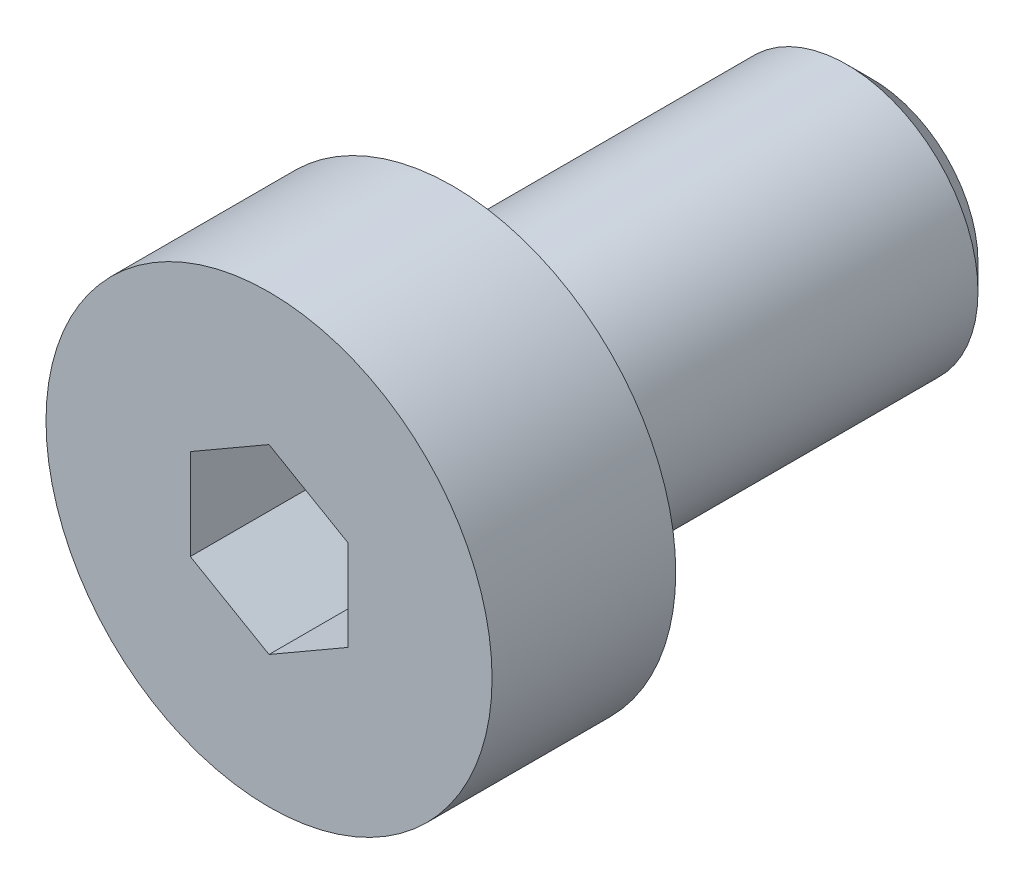
ISO-10303-21;
HEADER;
FILE_DESCRIPTION(('STEP AP214'),'2;1');
FILE_NAME('part.step','',(''),(''),'','','');
FILE_SCHEMA(('AUTOMOTIVE_DESIGN { 1 0 10303 214 1 1 1 1 }'));
ENDSEC;
DATA;
#1=APPLICATION_CONTEXT('core data for automotive mechanical design processes');
#2=APPLICATION_PROTOCOL_DEFINITION('international standard','automotive_design',2000,#1);
#3=PRODUCT_CONTEXT('',#1,'mechanical');
#4=PRODUCT('Part','Part','',(#3));
#5=PRODUCT_RELATED_PRODUCT_CATEGORY('part','',(#4));
#6=PRODUCT_DEFINITION_FORMATION('','',#4);
#7=PRODUCT_DEFINITION_CONTEXT('part definition',#1,'design');
#8=PRODUCT_DEFINITION('design','',#6,#7);
#9=PRODUCT_DEFINITION_SHAPE('','',#8);
#10=(LENGTH_UNIT() NAMED_UNIT(*) SI_UNIT(.MILLI.,.METRE.));
#11=(NAMED_UNIT(*) PLANE_ANGLE_UNIT() SI_UNIT($,.RADIAN.));
#12=(NAMED_UNIT(*) SI_UNIT($,.STERADIAN.) SOLID_ANGLE_UNIT());
#13=UNCERTAINTY_MEASURE_WITH_UNIT(LENGTH_MEASURE(1.E-05),#10,'distance_accuracy_value','');
#14=(GEOMETRIC_REPRESENTATION_CONTEXT(3) GLOBAL_UNCERTAINTY_ASSIGNED_CONTEXT((#13)) GLOBAL_UNIT_ASSIGNED_CONTEXT((#10,
#11,#12)) REPRESENTATION_CONTEXT('',''));
#15=CARTESIAN_POINT('',(0.,0.,0.));
#16=DIRECTION('',(0.,0.,1.));
#17=DIRECTION('',(1.,0.,0.));
#18=AXIS2_PLACEMENT_3D('',#15,#16,#17);
#19=CARTESIAN_POINT('',(13.,21.5,-3.3));
#20=DIRECTION('',(0.,0.,-1.));
#21=DIRECTION('',(-1.,0.,0.));
#22=AXIS2_PLACEMENT_3D('',#19,#20,#21);
#23=PLANE('',#22);
#24=DIRECTION('',(-0.866025403784439,0.5,0.));
#25=VECTOR('',#24,1.);
#26=CARTESIAN_POINT('',(14.5,22.3660254037844,-3.3));
#27=LINE('',#26,#25);
#28=CARTESIAN_POINT('',(13.7500000000045,22.7990381056845,-3.29999999999793));
#29=VERTEX_POINT('',#28);
#30=CARTESIAN_POINT('',(13.,23.2320508075689,-3.3));
#31=VERTEX_POINT('',#30);
#32=EDGE_CURVE('E179',#29,#31,#27,.T.);
#33=ORIENTED_EDGE('',*,*,#32,.T.);
#34=DIRECTION('',(-0.866025403784439,-0.5,0.));
#35=VECTOR('',#34,1.);
#36=CARTESIAN_POINT('',(13.,23.2320508075689,-3.3));
#37=LINE('',#36,#35);
#38=CARTESIAN_POINT('',(12.2499999999955,22.7990381056846,-3.29999999999793));
#39=VERTEX_POINT('',#38);
#40=EDGE_CURVE('E169',#31,#39,#37,.T.);
#41=ORIENTED_EDGE('',*,*,#40,.T.);
#42=CARTESIAN_POINT('',(13.,21.5,-3.29999999999586));
#43=DIRECTION('',(0.,0.,1.));
#44=DIRECTION('',(1.,0.,0.));
#45=AXIS2_PLACEMENT_3D('',#42,#43,#44);
#46=CIRCLE('',#45,1.50000000001819);
#47=EDGE_CURVE('E130',#39,#29,#46,.F.);
#48=ORIENTED_EDGE('',*,*,#47,.T.);
#49=EDGE_LOOP('',(#33,#41,#48));
#50=FACE_BOUND('',#49,.T.);
#51=ADVANCED_FACE('F17',(#50),#23,.F.);
#52=CARTESIAN_POINT('',(13.,21.5,-3.3));
#53=DIRECTION('',(0.,0.,-1.));
#54=DIRECTION('',(-1.,0.,0.));
#55=AXIS2_PLACEMENT_3D('',#52,#53,#54);
#56=PLANE('',#55);
#57=DIRECTION('',(0.,1.,0.));
#58=VECTOR('',#57,1.);
#59=CARTESIAN_POINT('',(14.5,20.6339745962156,-3.3));
#60=LINE('',#59,#58);
#61=CARTESIAN_POINT('',(14.5000000000091,21.5,-3.29999999999793));
#62=VERTEX_POINT('',#61);
#63=CARTESIAN_POINT('',(14.5,22.3660254037844,-3.3));
#64=VERTEX_POINT('',#63);
#65=EDGE_CURVE('E147',#62,#64,#60,.T.);
#66=ORIENTED_EDGE('',*,*,#65,.T.);
#67=DIRECTION('',(-0.866025403784439,0.5,0.));
#68=VECTOR('',#67,1.);
#69=CARTESIAN_POINT('',(14.5,22.3660254037844,-3.3));
#70=LINE('',#69,#68);
#71=EDGE_CURVE('E176',#64,#29,#70,.T.);
#72=ORIENTED_EDGE('',*,*,#71,.T.);
#73=CARTESIAN_POINT('',(13.,21.5,-3.29999999999586));
#74=DIRECTION('',(0.,0.,1.));
#75=DIRECTION('',(1.,0.,0.));
#76=AXIS2_PLACEMENT_3D('',#73,#74,#75);
#77=CIRCLE('',#76,1.50000000001819);
#78=EDGE_CURVE('E180',#62,#29,#77,.T.);
#79=ORIENTED_EDGE('',*,*,#78,.F.);
#80=EDGE_LOOP('',(#66,#72,#79));
#81=FACE_BOUND('',#80,.T.);
#82=ADVANCED_FACE('F512',(#81),#56,.F.);
#83=CARTESIAN_POINT('',(14.5,22.3660254037844,-0.6));
#84=DIRECTION('',(0.5,0.866025403784439,0.));
#85=DIRECTION('',(-0.866025403784439,0.5,0.));
#86=AXIS2_PLACEMENT_3D('',#83,#84,#85);
#87=PLANE('',#86);
#88=DIRECTION('',(0.,0.,1.));
#89=VECTOR('',#88,1.);
#90=CARTESIAN_POINT('',(13.,23.2320508075689,-0.6));
#91=LINE('',#90,#89);
#92=CARTESIAN_POINT('',(13.,23.2320508075689,-0.6));
#93=VERTEX_POINT('',#92);
#94=EDGE_CURVE('E188',#93,#31,#91,.F.);
#95=ORIENTED_EDGE('',*,*,#94,.T.);
#96=ORIENTED_EDGE('',*,*,#32,.F.);
#97=ORIENTED_EDGE('',*,*,#71,.F.);
#98=DIRECTION('',(0.,0.,-1.));
#99=VECTOR('',#98,1.);
#100=CARTESIAN_POINT('',(14.5,22.3660254037844,-0.6));
#101=LINE('',#100,#99);
#102=CARTESIAN_POINT('',(14.5,22.3660254037844,-0.6));
#103=VERTEX_POINT('',#102);
#104=EDGE_CURVE('E173',#64,#103,#101,.F.);
#105=ORIENTED_EDGE('',*,*,#104,.T.);
#106=DIRECTION('',(-0.866025403784439,0.5,0.));
#107=VECTOR('',#106,1.);
#108=CARTESIAN_POINT('',(14.5,22.3660254037844,-0.6));
#109=LINE('',#108,#107);
#110=EDGE_CURVE('E193',#93,#103,#109,.F.);
#111=ORIENTED_EDGE('',*,*,#110,.F.);
#112=EDGE_LOOP('',(#95,#96,#97,#105,#111));
#113=FACE_BOUND('',#112,.T.);
#114=ADVANCED_FACE('F502',(#113),#87,.F.);
#115=CARTESIAN_POINT('',(13.,23.2320508075689,-0.6));
#116=DIRECTION('',(-0.5,0.866025403784439,0.));
#117=DIRECTION('',(-0.866025403784439,-0.5,0.));
#118=AXIS2_PLACEMENT_3D('',#115,#116,#117);
#119=PLANE('',#118);
#120=DIRECTION('',(0.,0.,1.));
#121=VECTOR('',#120,1.);
#122=CARTESIAN_POINT('',(11.5,22.3660254037844,-0.6));
#123=LINE('',#122,#121);
#124=CARTESIAN_POINT('',(11.5,22.3660254037844,-0.6));
#125=VERTEX_POINT('',#124);
#126=CARTESIAN_POINT('',(11.5,22.3660254037844,-3.3));
#127=VERTEX_POINT('',#126);
#128=EDGE_CURVE('E155',#125,#127,#123,.F.);
#129=ORIENTED_EDGE('',*,*,#128,.T.);
#130=DIRECTION('',(0.866025403784398,0.500000000000071,0.));
#131=VECTOR('',#130,1.);
#132=CARTESIAN_POINT('',(11.5,22.3660254037844,-3.3));
#133=LINE('',#132,#131);
#134=EDGE_CURVE('E112',#127,#39,#133,.T.);
#135=ORIENTED_EDGE('',*,*,#134,.T.);
#136=ORIENTED_EDGE('',*,*,#40,.F.);
#137=ORIENTED_EDGE('',*,*,#94,.F.);
#138=DIRECTION('',(-0.866025403784439,-0.5,0.));
#139=VECTOR('',#138,1.);
#140=CARTESIAN_POINT('',(13.,23.2320508075689,-0.6));
#141=LINE('',#140,#139);
#142=EDGE_CURVE('E164',#125,#93,#141,.F.);
#143=ORIENTED_EDGE('',*,*,#142,.F.);
#144=EDGE_LOOP('',(#129,#135,#136,#137,#143));
#145=FACE_BOUND('',#144,.T.);
#146=ADVANCED_FACE('F492',(#145),#119,.F.);
#147=CARTESIAN_POINT('',(13.,21.5,-3.3));
#148=DIRECTION('',(0.,0.,-1.));
#149=DIRECTION('',(-1.,0.,0.));
#150=AXIS2_PLACEMENT_3D('',#147,#148,#149);
#151=PLANE('',#150);
#152=ORIENTED_EDGE('',*,*,#134,.F.);
#153=DIRECTION('',(0.,1.,0.));
#154=VECTOR('',#153,1.);
#155=CARTESIAN_POINT('',(11.5,22.3660254037844,-3.3));
#156=LINE('',#155,#154);
#157=CARTESIAN_POINT('',(11.4999999999909,21.5,-3.29999999999793));
#158=VERTEX_POINT('',#157);
#159=EDGE_CURVE('E152',#127,#158,#156,.F.);
#160=ORIENTED_EDGE('',*,*,#159,.T.);
#161=CARTESIAN_POINT('',(13.,21.5,-3.29999999999586));
#162=DIRECTION('',(0.,0.,1.));
#163=DIRECTION('',(1.,0.,0.));
#164=AXIS2_PLACEMENT_3D('',#161,#162,#163);
#165=CIRCLE('',#164,1.50000000001819);
#166=EDGE_CURVE('E111',#158,#39,#165,.F.);
#167=ORIENTED_EDGE('',*,*,#166,.T.);
#168=EDGE_LOOP('',(#152,#160,#167));
#169=FACE_BOUND('',#168,.T.);
#170=ADVANCED_FACE('F483',(#169),#151,.F.);
#171=CARTESIAN_POINT('',(13.,21.5,-3.29999999999586));
#172=DIRECTION('',(0.,0.,1.));
#173=DIRECTION('',(1.,0.,0.));
#174=AXIS2_PLACEMENT_3D('',#171,#172,#173);
#175=CONICAL_SURFACE('',#174,1.50000000001819,1.22173047637907);
#176=CARTESIAN_POINT('',(13.,21.5,-3.29999999999586));
#177=DIRECTION('',(0.,0.,1.));
#178=DIRECTION('',(1.,0.,0.));
#179=AXIS2_PLACEMENT_3D('',#176,#177,#178);
#180=CIRCLE('',#179,1.50000000001819);
#181=CARTESIAN_POINT('',(13.7500000000045,20.2009618943154,-3.29999999999793));
#182=VERTEX_POINT('',#181);
#183=CARTESIAN_POINT('',(12.2499999999955,20.2009618943155,-3.29999999999793));
#184=VERTEX_POINT('',#183);
#185=EDGE_CURVE('E98',#182,#184,#180,.F.);
#186=ORIENTED_EDGE('',*,*,#185,.F.);
#187=CARTESIAN_POINT('',(13.,21.5,-3.29999999999586));
#188=DIRECTION('',(0.,0.,1.));
#189=DIRECTION('',(1.,0.,0.));
#190=AXIS2_PLACEMENT_3D('',#187,#188,#189);
#191=CIRCLE('',#190,1.50000000001819);
#192=EDGE_CURVE('E104',#182,#62,#191,.T.);
#193=ORIENTED_EDGE('',*,*,#192,.T.);
#194=ORIENTED_EDGE('',*,*,#78,.T.);
#195=ORIENTED_EDGE('',*,*,#47,.F.);
#196=ORIENTED_EDGE('',*,*,#166,.F.);
#197=CARTESIAN_POINT('',(13.,21.5,-3.29999999999586));
#198=DIRECTION('',(0.,0.,1.));
#199=DIRECTION('',(1.,0.,0.));
#200=AXIS2_PLACEMENT_3D('',#197,#198,#199);
#201=CIRCLE('',#200,1.50000000001819);
#202=EDGE_CURVE('E108',#158,#184,#201,.T.);
#203=ORIENTED_EDGE('',*,*,#202,.T.);
#204=EDGE_LOOP('',(#186,#193,#194,#195,#196,#203));
#205=FACE_BOUND('',#204,.T.);
#206=CARTESIAN_POINT('',(13.,21.50000000006,-3.84595535139454));
#207=VERTEX_POINT('',#206);
#208=VERTEX_LOOP('',#207);
#209=FACE_BOUND('',#208,.T.);
#210=ADVANCED_FACE('F100',(#205,#209),#175,.F.);
#211=CARTESIAN_POINT('',(13.,21.5,-3.3));
#212=DIRECTION('',(0.,0.,-1.));
#213=DIRECTION('',(-1.,0.,0.));
#214=AXIS2_PLACEMENT_3D('',#211,#212,#213);
#215=PLANE('',#214);
#216=DIRECTION('',(0.866025403784439,0.5,0.));
#217=VECTOR('',#216,1.);
#218=CARTESIAN_POINT('',(13.,19.7679491924311,-3.3));
#219=LINE('',#218,#217);
#220=CARTESIAN_POINT('',(14.5,20.6339745962156,-3.3));
#221=VERTEX_POINT('',#220);
#222=EDGE_CURVE('E123',#182,#221,#219,.T.);
#223=ORIENTED_EDGE('',*,*,#222,.T.);
#224=DIRECTION('',(0.,1.,0.));
#225=VECTOR('',#224,1.);
#226=CARTESIAN_POINT('',(14.5,20.6339745962156,-3.3));
#227=LINE('',#226,#225);
#228=EDGE_CURVE('E128',#221,#62,#227,.T.);
#229=ORIENTED_EDGE('',*,*,#228,.T.);
#230=ORIENTED_EDGE('',*,*,#192,.F.);
#231=EDGE_LOOP('',(#223,#229,#230));
#232=FACE_BOUND('',#231,.T.);
#233=ADVANCED_FACE('F126',(#232),#215,.F.);
#234=CARTESIAN_POINT('',(14.5,20.6339745962156,-0.6));
#235=DIRECTION('',(1.,0.,0.));
#236=DIRECTION('',(0.,0.,-1.));
#237=AXIS2_PLACEMENT_3D('',#234,#235,#236);
#238=PLANE('',#237);
#239=ORIENTED_EDGE('',*,*,#104,.F.);
#240=ORIENTED_EDGE('',*,*,#65,.F.);
#241=ORIENTED_EDGE('',*,*,#228,.F.);
#242=DIRECTION('',(0.,0.,1.));
#243=VECTOR('',#242,1.);
#244=CARTESIAN_POINT('',(14.5,20.6339745962156,-0.6));
#245=LINE('',#244,#243);
#246=CARTESIAN_POINT('',(14.5,20.6339745962156,-0.6));
#247=VERTEX_POINT('',#246);
#248=EDGE_CURVE('E136',#221,#247,#245,.T.);
#249=ORIENTED_EDGE('',*,*,#248,.T.);
#250=DIRECTION('',(0.,1.,0.));
#251=VECTOR('',#250,1.);
#252=CARTESIAN_POINT('',(14.5,20.6339745962156,-0.6));
#253=LINE('',#252,#251);
#254=EDGE_CURVE('E159',#103,#247,#253,.F.);
#255=ORIENTED_EDGE('',*,*,#254,.F.);
#256=EDGE_LOOP('',(#239,#240,#241,#249,#255));
#257=FACE_BOUND('',#256,.T.);
#258=ADVANCED_FACE('F285',(#257),#238,.F.);
#259=CARTESIAN_POINT('',(11.5,22.3660254037844,-0.6));
#260=DIRECTION('',(-1.,0.,0.));
#261=DIRECTION('',(0.,0.,1.));
#262=AXIS2_PLACEMENT_3D('',#259,#260,#261);
#263=PLANE('',#262);
#264=DIRECTION('',(0.,0.,1.));
#265=VECTOR('',#264,1.);
#266=CARTESIAN_POINT('',(11.5,20.6339745962156,-0.6));
#267=LINE('',#266,#265);
#268=CARTESIAN_POINT('',(11.5,20.6339745962156,-0.6));
#269=VERTEX_POINT('',#268);
#270=CARTESIAN_POINT('',(11.5,20.6339745962156,-3.3));
#271=VERTEX_POINT('',#270);
#272=EDGE_CURVE('E238',#269,#271,#267,.F.);
#273=ORIENTED_EDGE('',*,*,#272,.T.);
#274=DIRECTION('',(0.,1.,0.));
#275=VECTOR('',#274,1.);
#276=CARTESIAN_POINT('',(11.5,21.5,-3.3));
#277=LINE('',#276,#275);
#278=EDGE_CURVE('E216',#271,#158,#277,.T.);
#279=ORIENTED_EDGE('',*,*,#278,.T.);
#280=ORIENTED_EDGE('',*,*,#159,.F.);
#281=ORIENTED_EDGE('',*,*,#128,.F.);
#282=DIRECTION('',(0.,1.,0.));
#283=VECTOR('',#282,1.);
#284=CARTESIAN_POINT('',(11.5,22.3660254037844,-0.6));
#285=LINE('',#284,#283);
#286=EDGE_CURVE('E154',#269,#125,#285,.T.);
#287=ORIENTED_EDGE('',*,*,#286,.F.);
#288=EDGE_LOOP('',(#273,#279,#280,#281,#287));
#289=FACE_BOUND('',#288,.T.);
#290=ADVANCED_FACE('F273',(#289),#263,.F.);
#291=CARTESIAN_POINT('',(13.,21.5,-3.3));
#292=DIRECTION('',(0.,0.,-1.));
#293=DIRECTION('',(-1.,0.,0.));
#294=AXIS2_PLACEMENT_3D('',#291,#292,#293);
#295=PLANE('',#294);
#296=ORIENTED_EDGE('',*,*,#278,.F.);
#297=DIRECTION('',(0.866025403784439,-0.5,0.));
#298=VECTOR('',#297,1.);
#299=CARTESIAN_POINT('',(11.5,20.6339745962156,-3.3));
#300=LINE('',#299,#298);
#301=EDGE_CURVE('E239',#271,#184,#300,.T.);
#302=ORIENTED_EDGE('',*,*,#301,.T.);
#303=ORIENTED_EDGE('',*,*,#202,.F.);
#304=EDGE_LOOP('',(#296,#302,#303));
#305=FACE_BOUND('',#304,.T.);
#306=ADVANCED_FACE('F276',(#305),#295,.F.);
#307=CARTESIAN_POINT('',(13.,21.5,-3.3));
#308=DIRECTION('',(0.,0.,-1.));
#309=DIRECTION('',(-1.,0.,0.));
#310=AXIS2_PLACEMENT_3D('',#307,#308,#309);
#311=PLANE('',#310);
#312=DIRECTION('',(0.866025403784439,-0.5,0.));
#313=VECTOR('',#312,1.);
#314=CARTESIAN_POINT('',(11.5,20.6339745962156,-3.3));
#315=LINE('',#314,#313);
#316=CARTESIAN_POINT('',(13.,19.7679491924311,-3.3));
#317=VERTEX_POINT('',#316);
#318=EDGE_CURVE('E118',#184,#317,#315,.T.);
#319=ORIENTED_EDGE('',*,*,#318,.T.);
#320=DIRECTION('',(0.866025403784439,0.5,0.));
#321=VECTOR('',#320,1.);
#322=CARTESIAN_POINT('',(13.,19.7679491924311,-3.3));
#323=LINE('',#322,#321);
#324=EDGE_CURVE('E115',#317,#182,#323,.T.);
#325=ORIENTED_EDGE('',*,*,#324,.T.);
#326=ORIENTED_EDGE('',*,*,#185,.T.);
#327=EDGE_LOOP('',(#319,#325,#326));
#328=FACE_BOUND('',#327,.T.);
#329=ADVANCED_FACE('F116',(#328),#311,.F.);
#330=CARTESIAN_POINT('',(13.,19.7679491924311,-0.6));
#331=DIRECTION('',(0.5,-0.866025403784439,0.));
#332=DIRECTION('',(0.866025403784439,0.5,0.));
#333=AXIS2_PLACEMENT_3D('',#330,#331,#332);
#334=PLANE('',#333);
#335=ORIENTED_EDGE('',*,*,#248,.F.);
#336=ORIENTED_EDGE('',*,*,#222,.F.);
#337=ORIENTED_EDGE('',*,*,#324,.F.);
#338=DIRECTION('',(0.,0.,1.));
#339=VECTOR('',#338,1.);
#340=CARTESIAN_POINT('',(13.,19.7679491924311,-0.6));
#341=LINE('',#340,#339);
#342=CARTESIAN_POINT('',(13.,19.7679491924311,-0.6));
#343=VERTEX_POINT('',#342);
#344=EDGE_CURVE('E244',#317,#343,#341,.T.);
#345=ORIENTED_EDGE('',*,*,#344,.T.);
#346=DIRECTION('',(0.866025403784439,0.5,0.));
#347=VECTOR('',#346,1.);
#348=CARTESIAN_POINT('',(13.,19.7679491924311,-0.6));
#349=LINE('',#348,#347);
#350=EDGE_CURVE('E138',#247,#343,#349,.F.);
#351=ORIENTED_EDGE('',*,*,#350,.F.);
#352=EDGE_LOOP('',(#335,#336,#337,#345,#351));
#353=FACE_BOUND('',#352,.T.);
#354=ADVANCED_FACE('F133',(#353),#334,.F.);
#355=CARTESIAN_POINT('',(11.5,20.6339745962156,-0.6));
#356=DIRECTION('',(-0.5,-0.866025403784439,0.));
#357=DIRECTION('',(0.866025403784439,-0.5,0.));
#358=AXIS2_PLACEMENT_3D('',#355,#356,#357);
#359=PLANE('',#358);
#360=ORIENTED_EDGE('',*,*,#344,.F.);
#361=ORIENTED_EDGE('',*,*,#318,.F.);
#362=ORIENTED_EDGE('',*,*,#301,.F.);
#363=ORIENTED_EDGE('',*,*,#272,.F.);
#364=DIRECTION('',(-0.866025403784424,0.500000000000026,0.));
#365=VECTOR('',#364,1.);
#366=CARTESIAN_POINT('',(13.,19.7679491924311,-0.6));
#367=LINE('',#366,#365);
#368=EDGE_CURVE('E215',#343,#269,#367,.T.);
#369=ORIENTED_EDGE('',*,*,#368,.F.);
#370=EDGE_LOOP('',(#360,#361,#362,#363,#369));
#371=FACE_BOUND('',#370,.T.);
#372=ADVANCED_FACE('F269',(#371),#359,.F.);
#373=CARTESIAN_POINT('',(13.,19.375,-0.6));
#374=DIRECTION('',(0.,0.,1.));
#375=DIRECTION('',(1.,0.,0.));
#376=AXIS2_PLACEMENT_3D('',#373,#374,#375);
#377=PLANE('',#376);
#378=CARTESIAN_POINT('',(13.,21.5,-0.6));
#379=DIRECTION('',(0.,0.,-1.));
#380=DIRECTION('',(-1.,0.,0.));
#381=AXIS2_PLACEMENT_3D('',#378,#379,#380);
#382=CIRCLE('',#381,4.25);
#383=CARTESIAN_POINT('',(8.75,21.5,-0.6));
#384=VERTEX_POINT('',#383);
#385=EDGE_CURVE('E212',#384,#384,#382,.T.);
#386=ORIENTED_EDGE('',*,*,#385,.F.);
#387=EDGE_LOOP('',(#386));
#388=FACE_BOUND('',#387,.T.);
#389=ORIENTED_EDGE('',*,*,#350,.T.);
#390=ORIENTED_EDGE('',*,*,#368,.T.);
#391=ORIENTED_EDGE('',*,*,#286,.T.);
#392=ORIENTED_EDGE('',*,*,#142,.T.);
#393=ORIENTED_EDGE('',*,*,#110,.T.);
#394=ORIENTED_EDGE('',*,*,#254,.T.);
#395=EDGE_LOOP('',(#389,#390,#391,#392,#393,#394));
#396=FACE_BOUND('',#395,.T.);
#397=ADVANCED_FACE('F265',(#388,#396),#377,.T.);
#398=CARTESIAN_POINT('',(13.,21.5,-2.35));
#399=DIRECTION('',(0.,0.,-1.));
#400=DIRECTION('',(-1.,0.,0.));
#401=AXIS2_PLACEMENT_3D('',#398,#399,#400);
#402=CYLINDRICAL_SURFACE('',#401,4.25);
#403=ORIENTED_EDGE('',*,*,#385,.T.);
#404=EDGE_LOOP('',(#403));
#405=FACE_BOUND('',#404,.T.);
#406=CARTESIAN_POINT('',(13.,21.5,-4.1));
#407=DIRECTION('',(0.,0.,-1.));
#408=DIRECTION('',(-1.,0.,0.));
#409=AXIS2_PLACEMENT_3D('',#406,#407,#408);
#410=CIRCLE('',#409,4.25);
#411=CARTESIAN_POINT('',(8.75,21.5,-4.1));
#412=VERTEX_POINT('',#411);
#413=EDGE_CURVE('E209',#412,#412,#410,.T.);
#414=ORIENTED_EDGE('',*,*,#413,.F.);
#415=EDGE_LOOP('',(#414));
#416=FACE_BOUND('',#415,.T.);
#417=ADVANCED_FACE('F350',(#405,#416),#402,.T.);
#418=CARTESIAN_POINT('',(13.,20.49525,-12.1));
#419=DIRECTION('',(0.,0.,-1.));
#420=DIRECTION('',(-1.,0.,0.));
#421=AXIS2_PLACEMENT_3D('',#418,#419,#420);
#422=PLANE('',#421);
#423=CARTESIAN_POINT('',(13.,21.5,-12.0999999999754));
#424=DIRECTION('',(0.,0.,1.));
#425=DIRECTION('',(1.,0.,0.));
#426=AXIS2_PLACEMENT_3D('',#423,#424,#425);
#427=CIRCLE('',#426,2.00950000003923);
#428=CARTESIAN_POINT('',(15.0095000000392,21.5,-12.0999999999754));
#429=VERTEX_POINT('',#428);
#430=EDGE_CURVE('E205',#429,#429,#427,.T.);
#431=ORIENTED_EDGE('',*,*,#430,.F.);
#432=EDGE_LOOP('',(#431));
#433=FACE_BOUND('',#432,.T.);
#434=ADVANCED_FACE('F316',(#433),#422,.T.);
#435=CARTESIAN_POINT('',(13.,18.025,-4.1));
#436=DIRECTION('',(0.,0.,-1.));
#437=DIRECTION('',(-1.,0.,0.));
#438=AXIS2_PLACEMENT_3D('',#435,#436,#437);
#439=PLANE('',#438);
#440=CARTESIAN_POINT('',(13.,21.5,-4.1));
#441=DIRECTION('',(0.,0.,-1.));
#442=DIRECTION('',(-1.,0.,0.));
#443=AXIS2_PLACEMENT_3D('',#440,#441,#442);
#444=CIRCLE('',#443,2.7);
#445=CARTESIAN_POINT('',(15.7,21.5,-4.1));
#446=VERTEX_POINT('',#445);
#447=CARTESIAN_POINT('',(10.3,21.5,-4.1));
#448=VERTEX_POINT('',#447);
#449=EDGE_CURVE('E208',#446,#448,#444,.F.);
#450=ORIENTED_EDGE('',*,*,#449,.T.);
#451=CARTESIAN_POINT('',(13.,21.5,-4.1));
#452=DIRECTION('',(0.,0.,-1.));
#453=DIRECTION('',(0.,-1.,0.));
#454=AXIS2_PLACEMENT_3D('',#451,#452,#453);
#455=CIRCLE('',#454,2.7);
#456=CARTESIAN_POINT('',(13.,18.8,-4.1));
#457=VERTEX_POINT('',#456);
#458=EDGE_CURVE('E227',#448,#457,#455,.F.);
#459=ORIENTED_EDGE('',*,*,#458,.T.);
#460=CARTESIAN_POINT('',(13.,21.5,-4.1));
#461=DIRECTION('',(0.,0.,-1.));
#462=DIRECTION('',(1.,0.,0.));
#463=AXIS2_PLACEMENT_3D('',#460,#461,#462);
#464=CIRCLE('',#463,2.7);
#465=EDGE_CURVE('E37',#457,#446,#464,.F.);
#466=ORIENTED_EDGE('',*,*,#465,.T.);
#467=EDGE_LOOP('',(#450,#459,#466));
#468=FACE_BOUND('',#467,.T.);
#469=ORIENTED_EDGE('',*,*,#413,.T.);
#470=EDGE_LOOP('',(#469));
#471=FACE_BOUND('',#470,.T.);
#472=ADVANCED_FACE('F307',(#468,#471),#439,.T.);
#473=CARTESIAN_POINT('',(13.,21.5,-11.60950000002));
#474=DIRECTION('',(0.,0.,1.));
#475=DIRECTION('',(1.,0.,0.));
#476=AXIS2_PLACEMENT_3D('',#473,#474,#475);
#477=CONICAL_SURFACE('',#476,2.49999999999454,0.785398163397448);
#478=ORIENTED_EDGE('',*,*,#430,.T.);
#479=EDGE_LOOP('',(#478));
#480=FACE_BOUND('',#479,.T.);
#481=CARTESIAN_POINT('',(13.,21.5,-11.6095));
#482=DIRECTION('',(0.,0.,-1.));
#483=DIRECTION('',(-1.,0.,0.));
#484=AXIS2_PLACEMENT_3D('',#481,#482,#483);
#485=CIRCLE('',#484,2.5);
#486=CARTESIAN_POINT('',(10.5,21.5,-11.6095));
#487=VERTEX_POINT('',#486);
#488=EDGE_CURVE('E28',#487,#487,#485,.F.);
#489=ORIENTED_EDGE('',*,*,#488,.F.);
#490=EDGE_LOOP('',(#489));
#491=FACE_BOUND('',#490,.T.);
#492=ADVANCED_FACE('F293',(#480,#491),#477,.T.);
#493=CARTESIAN_POINT('',(13.,21.5,-4.3));
#494=DIRECTION('',(0.,0.,1.));
#495=DIRECTION('',(-1.,0.,0.));
#496=AXIS2_PLACEMENT_3D('',#493,#494,#495);
#497=TOROIDAL_SURFACE('',#496,2.7,0.2);
#498=ORIENTED_EDGE('',*,*,#458,.F.);
#499=ORIENTED_EDGE('',*,*,#449,.F.);
#500=ORIENTED_EDGE('',*,*,#465,.F.);
#501=EDGE_LOOP('',(#498,#499,#500));
#502=FACE_BOUND('',#501,.T.);
#503=CARTESIAN_POINT('',(13.,21.5,-4.3));
#504=DIRECTION('',(0.,0.,-1.));
#505=DIRECTION('',(-1.,0.,0.));
#506=AXIS2_PLACEMENT_3D('',#503,#504,#505);
#507=CIRCLE('',#506,2.5);
#508=CARTESIAN_POINT('',(10.5,21.5,-4.3));
#509=VERTEX_POINT('',#508);
#510=EDGE_CURVE('E11',#509,#509,#507,.T.);
#511=ORIENTED_EDGE('',*,*,#510,.F.);
#512=EDGE_LOOP('',(#511));
#513=FACE_BOUND('',#512,.T.);
#514=ADVANCED_FACE('F224',(#502,#513),#497,.F.);
#515=CARTESIAN_POINT('',(13.,21.5,-7.95475));
#516=DIRECTION('',(0.,0.,-1.));
#517=DIRECTION('',(-1.,0.,0.));
#518=AXIS2_PLACEMENT_3D('',#515,#516,#517);
#519=CYLINDRICAL_SURFACE('',#518,2.5);
#520=ORIENTED_EDGE('',*,*,#488,.T.);
#521=EDGE_LOOP('',(#520));
#522=FACE_BOUND('',#521,.T.);
#523=ORIENTED_EDGE('',*,*,#510,.T.);
#524=EDGE_LOOP('',(#523));
#525=FACE_BOUND('',#524,.T.);
#526=ADVANCED_FACE('F287',(#522,#525),#519,.T.);
#527=CLOSED_SHELL('',(#51,#82,#114,#146,#170,#210,#233,#258,#290,#306,#329,#354,#372,#397,#417,
#434,#472,#492,#514,#526));
#528=MANIFOLD_SOLID_BREP('B1',#527);
#529=ADVANCED_BREP_SHAPE_REPRESENTATION('',(#18,#528),#14);
#530=SHAPE_DEFINITION_REPRESENTATION(#9,#529);
ENDSEC;
END-ISO-10303-21;
